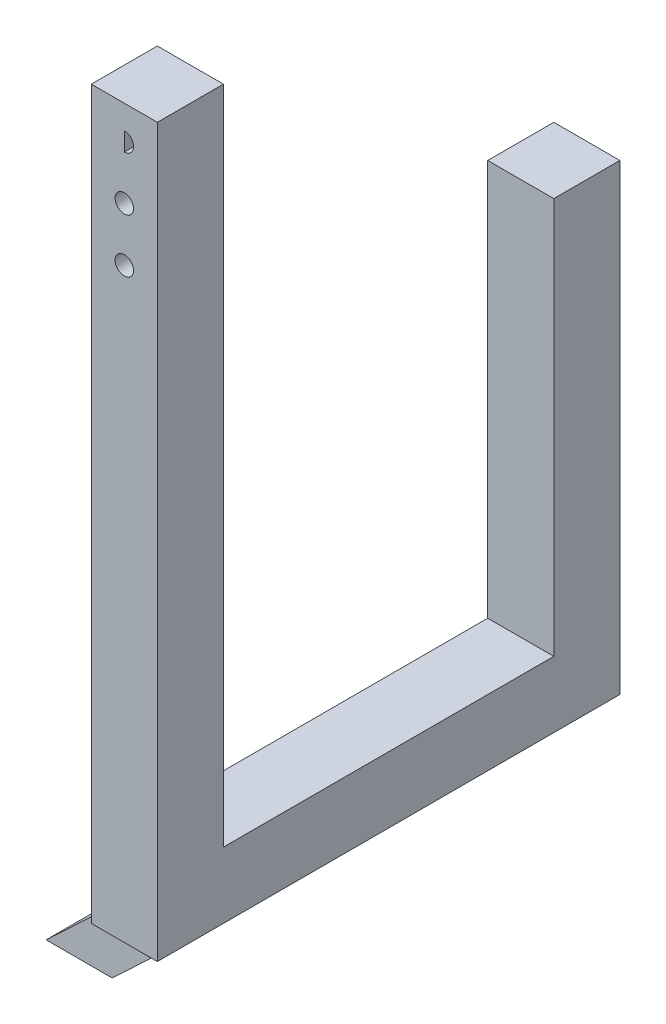
ISO-10303-21;
HEADER;
FILE_DESCRIPTION(('STEP AP214'),'2;1');
FILE_NAME('part.step','',(''),(''),'','','');
FILE_SCHEMA(('AUTOMOTIVE_DESIGN { 1 0 10303 214 1 1 1 1 }'));
ENDSEC;
DATA;
#1=APPLICATION_CONTEXT('core data for automotive mechanical design processes');
#2=APPLICATION_PROTOCOL_DEFINITION('international standard','automotive_design',2000,#1);
#3=PRODUCT_CONTEXT('',#1,'mechanical');
#4=PRODUCT('Part','Part','',(#3));
#5=PRODUCT_RELATED_PRODUCT_CATEGORY('part','',(#4));
#6=PRODUCT_DEFINITION_FORMATION('','',#4);
#7=PRODUCT_DEFINITION_CONTEXT('part definition',#1,'design');
#8=PRODUCT_DEFINITION('design','',#6,#7);
#9=PRODUCT_DEFINITION_SHAPE('','',#8);
#10=(LENGTH_UNIT() NAMED_UNIT(*) SI_UNIT(.MILLI.,.METRE.));
#11=(NAMED_UNIT(*) PLANE_ANGLE_UNIT() SI_UNIT($,.RADIAN.));
#12=(NAMED_UNIT(*) SI_UNIT($,.STERADIAN.) SOLID_ANGLE_UNIT());
#13=UNCERTAINTY_MEASURE_WITH_UNIT(LENGTH_MEASURE(1.E-05),#10,'distance_accuracy_value','');
#14=(GEOMETRIC_REPRESENTATION_CONTEXT(3) GLOBAL_UNCERTAINTY_ASSIGNED_CONTEXT((#13)) GLOBAL_UNIT_ASSIGNED_CONTEXT((#10,
#11,#12)) REPRESENTATION_CONTEXT('',''));
#15=CARTESIAN_POINT('',(0.,0.,0.));
#16=DIRECTION('',(0.,0.,1.));
#17=DIRECTION('',(1.,0.,0.));
#18=AXIS2_PLACEMENT_3D('',#15,#16,#17);
#19=CARTESIAN_POINT('',(0.,0.,12.7));
#20=DIRECTION('',(0.,1.,0.));
#21=DIRECTION('',(0.,0.,1.));
#22=AXIS2_PLACEMENT_3D('',#19,#20,#21);
#23=PLANE('',#22);
#24=DIRECTION('',(1.,0.,0.));
#25=VECTOR('',#24,1.);
#26=CARTESIAN_POINT('',(0.,0.,-63.5));
#27=LINE('',#26,#25);
#28=CARTESIAN_POINT('',(0.,0.,-63.5));
#29=VERTEX_POINT('',#28);
#30=CARTESIAN_POINT('',(12.7,0.,-63.5));
#31=VERTEX_POINT('',#30);
#32=EDGE_CURVE('E403',#29,#31,#27,.T.);
#33=ORIENTED_EDGE('',*,*,#32,.T.);
#34=DIRECTION('',(0.,0.,-1.));
#35=VECTOR('',#34,1.);
#36=CARTESIAN_POINT('',(12.7,0.,12.7));
#37=LINE('',#36,#35);
#38=CARTESIAN_POINT('',(12.7,0.,-19.05));
#39=VERTEX_POINT('',#38);
#40=EDGE_CURVE('E187',#39,#31,#37,.T.);
#41=ORIENTED_EDGE('',*,*,#40,.F.);
#42=DIRECTION('',(-1.,0.,0.));
#43=VECTOR('',#42,1.);
#44=CARTESIAN_POINT('',(12.7,0.,-19.05));
#45=LINE('',#44,#43);
#46=CARTESIAN_POINT('',(0.,0.,-19.05));
#47=VERTEX_POINT('',#46);
#48=EDGE_CURVE('E360',#39,#47,#45,.T.);
#49=ORIENTED_EDGE('',*,*,#48,.T.);
#50=DIRECTION('',(0.,0.,-1.));
#51=VECTOR('',#50,1.);
#52=CARTESIAN_POINT('',(0.,0.,12.7));
#53=LINE('',#52,#51);
#54=EDGE_CURVE('E268',#47,#29,#53,.T.);
#55=ORIENTED_EDGE('',*,*,#54,.T.);
#56=EDGE_LOOP('',(#33,#41,#49,#55));
#57=FACE_BOUND('',#56,.T.);
#58=ADVANCED_FACE('F40',(#57),#23,.F.);
#59=DIRECTION('',(-1.,0.,0.));
#60=VECTOR('',#59,1.);
#61=CARTESIAN_POINT('',(12.7,0.,-6.35));
#62=LINE('',#61,#60);
#63=CARTESIAN_POINT('',(12.7,0.,-6.35));
#64=VERTEX_POINT('',#63);
#65=CARTESIAN_POINT('',(0.,0.,-6.35));
#66=VERTEX_POINT('',#65);
#67=EDGE_CURVE('E189',#64,#66,#62,.T.);
#68=ORIENTED_EDGE('',*,*,#67,.F.);
#69=CARTESIAN_POINT('',(12.7,0.,12.7));
#70=VERTEX_POINT('',#69);
#71=EDGE_CURVE('E269',#70,#64,#37,.T.);
#72=ORIENTED_EDGE('',*,*,#71,.F.);
#73=DIRECTION('',(1.,0.,0.));
#74=VECTOR('',#73,1.);
#75=CARTESIAN_POINT('',(0.,0.,12.7));
#76=LINE('',#75,#74);
#77=CARTESIAN_POINT('',(0.,0.,12.7));
#78=VERTEX_POINT('',#77);
#79=EDGE_CURVE('E244',#78,#70,#76,.T.);
#80=ORIENTED_EDGE('',*,*,#79,.F.);
#81=EDGE_CURVE('E264',#78,#66,#53,.T.);
#82=ORIENTED_EDGE('',*,*,#81,.T.);
#83=EDGE_LOOP('',(#68,#72,#80,#82));
#84=FACE_BOUND('',#83,.T.);
#85=ADVANCED_FACE('F338',(#84),#23,.F.);
#86=CARTESIAN_POINT('',(0.,139.7,12.7));
#87=DIRECTION('',(0.,1.,0.));
#88=DIRECTION('',(0.,0.,1.));
#89=AXIS2_PLACEMENT_3D('',#86,#87,#88);
#90=PLANE('',#89);
#91=DIRECTION('',(1.,0.,0.));
#92=VECTOR('',#91,1.);
#93=CARTESIAN_POINT('',(0.,139.7,0.));
#94=LINE('',#93,#92);
#95=CARTESIAN_POINT('',(0.,139.7,0.));
#96=VERTEX_POINT('',#95);
#97=CARTESIAN_POINT('',(12.7,139.7,0.));
#98=VERTEX_POINT('',#97);
#99=EDGE_CURVE('E232',#96,#98,#94,.T.);
#100=ORIENTED_EDGE('',*,*,#99,.F.);
#101=DIRECTION('',(0.,0.,-1.));
#102=VECTOR('',#101,1.);
#103=CARTESIAN_POINT('',(0.,139.7,12.7));
#104=LINE('',#103,#102);
#105=CARTESIAN_POINT('',(0.,139.7,12.7));
#106=VERTEX_POINT('',#105);
#107=EDGE_CURVE('E260',#106,#96,#104,.T.);
#108=ORIENTED_EDGE('',*,*,#107,.F.);
#109=DIRECTION('',(1.,0.,0.));
#110=VECTOR('',#109,1.);
#111=CARTESIAN_POINT('',(0.,139.7,12.7));
#112=LINE('',#111,#110);
#113=CARTESIAN_POINT('',(12.7,139.7,12.7));
#114=VERTEX_POINT('',#113);
#115=EDGE_CURVE('E236',#106,#114,#112,.T.);
#116=ORIENTED_EDGE('',*,*,#115,.T.);
#117=DIRECTION('',(0.,0.,-1.));
#118=VECTOR('',#117,1.);
#119=CARTESIAN_POINT('',(12.7,139.7,12.7));
#120=LINE('',#119,#118);
#121=EDGE_CURVE('E251',#114,#98,#120,.T.);
#122=ORIENTED_EDGE('',*,*,#121,.T.);
#123=EDGE_LOOP('',(#100,#108,#116,#122));
#124=FACE_BOUND('',#123,.T.);
#125=ADVANCED_FACE('F42',(#124),#90,.T.);
#126=CARTESIAN_POINT('',(0.,0.,12.7));
#127=DIRECTION('',(-1.,0.,0.));
#128=DIRECTION('',(0.,0.,1.));
#129=AXIS2_PLACEMENT_3D('',#126,#127,#128);
#130=PLANE('',#129);
#131=DIRECTION('',(0.,1.,0.));
#132=VECTOR('',#131,1.);
#133=CARTESIAN_POINT('',(0.,0.,0.));
#134=LINE('',#133,#132);
#135=CARTESIAN_POINT('',(0.,12.7,0.));
#136=VERTEX_POINT('',#135);
#137=EDGE_CURVE('E241',#136,#96,#134,.T.);
#138=ORIENTED_EDGE('',*,*,#137,.F.);
#139=DIRECTION('',(0.,0.,-1.));
#140=VECTOR('',#139,1.);
#141=CARTESIAN_POINT('',(0.,12.7,0.));
#142=LINE('',#141,#140);
#143=CARTESIAN_POINT('',(0.,12.7,-63.5));
#144=VERTEX_POINT('',#143);
#145=EDGE_CURVE('E218',#136,#144,#142,.T.);
#146=ORIENTED_EDGE('',*,*,#145,.T.);
#147=DIRECTION('',(0.,1.,0.));
#148=VECTOR('',#147,1.);
#149=CARTESIAN_POINT('',(0.,0.,-63.5));
#150=LINE('',#149,#148);
#151=CARTESIAN_POINT('',(0.,88.9,-63.5));
#152=VERTEX_POINT('',#151);
#153=EDGE_CURVE('E206',#144,#152,#150,.T.);
#154=ORIENTED_EDGE('',*,*,#153,.T.);
#155=DIRECTION('',(0.,0.,-1.));
#156=VECTOR('',#155,1.);
#157=CARTESIAN_POINT('',(0.,88.9,-63.5));
#158=LINE('',#157,#156);
#159=CARTESIAN_POINT('',(0.,88.9,-76.2));
#160=VERTEX_POINT('',#159);
#161=EDGE_CURVE('E209',#152,#160,#158,.T.);
#162=ORIENTED_EDGE('',*,*,#161,.T.);
#163=DIRECTION('',(0.,-1.,0.));
#164=VECTOR('',#163,1.);
#165=CARTESIAN_POINT('',(0.,0.,-76.2));
#166=LINE('',#165,#164);
#167=CARTESIAN_POINT('',(0.,0.,-76.2));
#168=VERTEX_POINT('',#167);
#169=EDGE_CURVE('E213',#160,#168,#166,.T.);
#170=ORIENTED_EDGE('',*,*,#169,.T.);
#171=DIRECTION('',(0.,0.,1.));
#172=VECTOR('',#171,1.);
#173=CARTESIAN_POINT('',(0.,0.,-76.2));
#174=LINE('',#173,#172);
#175=EDGE_CURVE('E391',#168,#29,#174,.T.);
#176=ORIENTED_EDGE('',*,*,#175,.T.);
#177=ORIENTED_EDGE('',*,*,#54,.F.);
#178=DIRECTION('',(0.,0.,1.));
#179=VECTOR('',#178,1.);
#180=CARTESIAN_POINT('',(0.,0.,-19.05));
#181=LINE('',#180,#179);
#182=EDGE_CURVE('E368',#47,#66,#181,.T.);
#183=ORIENTED_EDGE('',*,*,#182,.T.);
#184=ORIENTED_EDGE('',*,*,#81,.F.);
#185=DIRECTION('',(0.,1.,0.));
#186=VECTOR('',#185,1.);
#187=CARTESIAN_POINT('',(0.,0.,12.7));
#188=LINE('',#187,#186);
#189=EDGE_CURVE('E247',#78,#106,#188,.T.);
#190=ORIENTED_EDGE('',*,*,#189,.T.);
#191=ORIENTED_EDGE('',*,*,#107,.T.);
#192=EDGE_LOOP('',(#138,#146,#154,#162,#170,#176,#177,#183,#184,#190,#191));
#193=FACE_BOUND('',#192,.T.);
#194=ADVANCED_FACE('F320',(#193),#130,.T.);
#195=CARTESIAN_POINT('',(12.7,0.,12.7));
#196=DIRECTION('',(-1.,0.,0.));
#197=DIRECTION('',(0.,0.,1.));
#198=AXIS2_PLACEMENT_3D('',#195,#196,#197);
#199=PLANE('',#198);
#200=ORIENTED_EDGE('',*,*,#71,.T.);
#201=DIRECTION('',(0.,0.,1.));
#202=VECTOR('',#201,1.);
#203=CARTESIAN_POINT('',(12.7,0.,-19.05));
#204=LINE('',#203,#202);
#205=EDGE_CURVE('E308',#39,#64,#204,.T.);
#206=ORIENTED_EDGE('',*,*,#205,.F.);
#207=ORIENTED_EDGE('',*,*,#40,.T.);
#208=DIRECTION('',(0.,0.,1.));
#209=VECTOR('',#208,1.);
#210=CARTESIAN_POINT('',(12.7,0.,-76.2));
#211=LINE('',#210,#209);
#212=CARTESIAN_POINT('',(12.7,0.,-76.2));
#213=VERTEX_POINT('',#212);
#214=EDGE_CURVE('E166',#213,#31,#211,.T.);
#215=ORIENTED_EDGE('',*,*,#214,.F.);
#216=DIRECTION('',(0.,-1.,0.));
#217=VECTOR('',#216,1.);
#218=CARTESIAN_POINT('',(12.7,0.,-76.2));
#219=LINE('',#218,#217);
#220=CARTESIAN_POINT('',(12.7,88.9,-76.2));
#221=VERTEX_POINT('',#220);
#222=EDGE_CURVE('E183',#221,#213,#219,.T.);
#223=ORIENTED_EDGE('',*,*,#222,.F.);
#224=DIRECTION('',(0.,0.,-1.));
#225=VECTOR('',#224,1.);
#226=CARTESIAN_POINT('',(12.7,88.9,-63.5));
#227=LINE('',#226,#225);
#228=CARTESIAN_POINT('',(12.7,88.9,-63.5));
#229=VERTEX_POINT('',#228);
#230=EDGE_CURVE('E196',#229,#221,#227,.T.);
#231=ORIENTED_EDGE('',*,*,#230,.F.);
#232=DIRECTION('',(0.,1.,0.));
#233=VECTOR('',#232,1.);
#234=CARTESIAN_POINT('',(12.7,0.,-63.5));
#235=LINE('',#234,#233);
#236=CARTESIAN_POINT('',(12.7,12.7,-63.5));
#237=VERTEX_POINT('',#236);
#238=EDGE_CURVE('E202',#237,#229,#235,.T.);
#239=ORIENTED_EDGE('',*,*,#238,.F.);
#240=DIRECTION('',(0.,0.,-1.));
#241=VECTOR('',#240,1.);
#242=CARTESIAN_POINT('',(12.7,12.7,0.));
#243=LINE('',#242,#241);
#244=CARTESIAN_POINT('',(12.7,12.7,0.));
#245=VERTEX_POINT('',#244);
#246=EDGE_CURVE('E220',#245,#237,#243,.T.);
#247=ORIENTED_EDGE('',*,*,#246,.F.);
#248=DIRECTION('',(0.,1.,0.));
#249=VECTOR('',#248,1.);
#250=CARTESIAN_POINT('',(12.7,0.,0.));
#251=LINE('',#250,#249);
#252=EDGE_CURVE('E255',#245,#98,#251,.T.);
#253=ORIENTED_EDGE('',*,*,#252,.T.);
#254=ORIENTED_EDGE('',*,*,#121,.F.);
#255=DIRECTION('',(0.,1.,0.));
#256=VECTOR('',#255,1.);
#257=CARTESIAN_POINT('',(12.7,0.,12.7));
#258=LINE('',#257,#256);
#259=EDGE_CURVE('E240',#70,#114,#258,.T.);
#260=ORIENTED_EDGE('',*,*,#259,.F.);
#261=EDGE_LOOP('',(#200,#206,#207,#215,#223,#231,#239,#247,#253,#254,#260));
#262=FACE_BOUND('',#261,.T.);
#263=ADVANCED_FACE('F181',(#262),#199,.F.);
#264=CARTESIAN_POINT('',(0.,0.,12.7));
#265=DIRECTION('',(0.,0.,1.));
#266=DIRECTION('',(1.,0.,0.));
#267=AXIS2_PLACEMENT_3D('',#264,#265,#266);
#268=PLANE('',#267);
#269=CARTESIAN_POINT('',(6.35,112.7125,12.7));
#270=DIRECTION('',(0.,0.,1.));
#271=DIRECTION('',(1.,0.,0.));
#272=AXIS2_PLACEMENT_3D('',#269,#270,#271);
#273=CIRCLE('',#272,1.778);
#274=CARTESIAN_POINT('',(8.128,112.7125,12.7));
#275=VERTEX_POINT('',#274);
#276=EDGE_CURVE('E279',#275,#275,#273,.T.);
#277=ORIENTED_EDGE('',*,*,#276,.F.);
#278=EDGE_LOOP('',(#277));
#279=FACE_BOUND('',#278,.T.);
#280=DIRECTION('',(0.,-1.,0.));
#281=VECTOR('',#280,1.);
#282=CARTESIAN_POINT('',(6.35000000000002,0.,12.7));
#283=LINE('',#282,#281);
#284=CARTESIAN_POINT('',(6.35,135.128,12.7));
#285=VERTEX_POINT('',#284);
#286=CARTESIAN_POINT('',(6.35,131.572,12.7));
#287=VERTEX_POINT('',#286);
#288=EDGE_CURVE('E65',#285,#287,#283,.T.);
#289=ORIENTED_EDGE('',*,*,#288,.F.);
#290=CARTESIAN_POINT('',(6.35,133.35,12.7));
#291=DIRECTION('',(0.,0.,1.));
#292=DIRECTION('',(1.,0.,0.));
#293=AXIS2_PLACEMENT_3D('',#290,#291,#292);
#294=CIRCLE('',#293,1.778);
#295=EDGE_CURVE('E294',#287,#285,#294,.T.);
#296=ORIENTED_EDGE('',*,*,#295,.F.);
#297=EDGE_LOOP('',(#289,#296));
#298=FACE_BOUND('',#297,.T.);
#299=CARTESIAN_POINT('',(6.35,123.03125,12.7));
#300=DIRECTION('',(0.,0.,1.));
#301=DIRECTION('',(1.,0.,0.));
#302=AXIS2_PLACEMENT_3D('',#299,#300,#301);
#303=CIRCLE('',#302,1.778);
#304=CARTESIAN_POINT('',(8.128,123.03125,12.7));
#305=VERTEX_POINT('',#304);
#306=EDGE_CURVE('E299',#305,#305,#303,.T.);
#307=ORIENTED_EDGE('',*,*,#306,.F.);
#308=EDGE_LOOP('',(#307));
#309=FACE_BOUND('',#308,.T.);
#310=ORIENTED_EDGE('',*,*,#115,.F.);
#311=ORIENTED_EDGE('',*,*,#189,.F.);
#312=ORIENTED_EDGE('',*,*,#79,.T.);
#313=ORIENTED_EDGE('',*,*,#259,.T.);
#314=EDGE_LOOP('',(#310,#311,#312,#313));
#315=FACE_BOUND('',#314,.T.);
#316=ADVANCED_FACE('F333',(#279,#298,#309,#315),#268,.T.);
#317=CARTESIAN_POINT('',(0.,0.,0.));
#318=DIRECTION('',(0.,0.,1.));
#319=DIRECTION('',(1.,0.,0.));
#320=AXIS2_PLACEMENT_3D('',#317,#318,#319);
#321=PLANE('',#320);
#322=CARTESIAN_POINT('',(6.35,112.7125,0.));
#323=DIRECTION('',(0.,0.,1.));
#324=DIRECTION('',(1.,0.,0.));
#325=AXIS2_PLACEMENT_3D('',#322,#323,#324);
#326=CIRCLE('',#325,1.778);
#327=CARTESIAN_POINT('',(8.128,112.7125,0.));
#328=VERTEX_POINT('',#327);
#329=EDGE_CURVE('E44',#328,#328,#326,.T.);
#330=ORIENTED_EDGE('',*,*,#329,.T.);
#331=EDGE_LOOP('',(#330));
#332=FACE_BOUND('',#331,.T.);
#333=CARTESIAN_POINT('',(6.35,133.35,0.));
#334=DIRECTION('',(0.,0.,1.));
#335=DIRECTION('',(1.,0.,0.));
#336=AXIS2_PLACEMENT_3D('',#333,#334,#335);
#337=CIRCLE('',#336,1.778);
#338=CARTESIAN_POINT('',(6.35,131.572,0.));
#339=VERTEX_POINT('',#338);
#340=CARTESIAN_POINT('',(6.35,135.128,0.));
#341=VERTEX_POINT('',#340);
#342=EDGE_CURVE('E50',#339,#341,#337,.T.);
#343=ORIENTED_EDGE('',*,*,#342,.T.);
#344=DIRECTION('',(0.,-1.,0.));
#345=VECTOR('',#344,1.);
#346=CARTESIAN_POINT('',(6.35000000000002,0.,0.));
#347=LINE('',#346,#345);
#348=EDGE_CURVE('E12',#341,#339,#347,.T.);
#349=ORIENTED_EDGE('',*,*,#348,.T.);
#350=EDGE_LOOP('',(#343,#349));
#351=FACE_BOUND('',#350,.T.);
#352=CARTESIAN_POINT('',(6.35,123.03125,0.));
#353=DIRECTION('',(0.,0.,1.));
#354=DIRECTION('',(1.,0.,0.));
#355=AXIS2_PLACEMENT_3D('',#352,#353,#354);
#356=CIRCLE('',#355,1.778);
#357=CARTESIAN_POINT('',(8.128,123.03125,0.));
#358=VERTEX_POINT('',#357);
#359=EDGE_CURVE('E275',#358,#358,#356,.T.);
#360=ORIENTED_EDGE('',*,*,#359,.T.);
#361=EDGE_LOOP('',(#360));
#362=FACE_BOUND('',#361,.T.);
#363=ORIENTED_EDGE('',*,*,#252,.F.);
#364=DIRECTION('',(-1.,0.,0.));
#365=VECTOR('',#364,1.);
#366=CARTESIAN_POINT('',(12.7,12.7,0.));
#367=LINE('',#366,#365);
#368=EDGE_CURVE('E228',#245,#136,#367,.T.);
#369=ORIENTED_EDGE('',*,*,#368,.T.);
#370=ORIENTED_EDGE('',*,*,#137,.T.);
#371=ORIENTED_EDGE('',*,*,#99,.T.);
#372=EDGE_LOOP('',(#363,#369,#370,#371));
#373=FACE_BOUND('',#372,.T.);
#374=ADVANCED_FACE('F283',(#332,#351,#362,#373),#321,.F.);
#375=CARTESIAN_POINT('',(12.7,12.7,0.));
#376=DIRECTION('',(0.,1.,0.));
#377=DIRECTION('',(0.,0.,1.));
#378=AXIS2_PLACEMENT_3D('',#375,#376,#377);
#379=PLANE('',#378);
#380=ORIENTED_EDGE('',*,*,#145,.F.);
#381=ORIENTED_EDGE('',*,*,#368,.F.);
#382=ORIENTED_EDGE('',*,*,#246,.T.);
#383=DIRECTION('',(-1.,0.,0.));
#384=VECTOR('',#383,1.);
#385=CARTESIAN_POINT('',(12.7,12.7,-63.5));
#386=LINE('',#385,#384);
#387=EDGE_CURVE('E224',#237,#144,#386,.T.);
#388=ORIENTED_EDGE('',*,*,#387,.T.);
#389=EDGE_LOOP('',(#380,#381,#382,#388));
#390=FACE_BOUND('',#389,.T.);
#391=ADVANCED_FACE('F323',(#390),#379,.T.);
#392=CARTESIAN_POINT('',(12.7,0.,-63.5));
#393=DIRECTION('',(0.,0.,1.));
#394=DIRECTION('',(1.,0.,0.));
#395=AXIS2_PLACEMENT_3D('',#392,#393,#394);
#396=PLANE('',#395);
#397=ORIENTED_EDGE('',*,*,#387,.F.);
#398=ORIENTED_EDGE('',*,*,#238,.T.);
#399=DIRECTION('',(-1.,0.,0.));
#400=VECTOR('',#399,1.);
#401=CARTESIAN_POINT('',(12.7,88.9,-63.5));
#402=LINE('',#401,#400);
#403=EDGE_CURVE('E195',#229,#152,#402,.T.);
#404=ORIENTED_EDGE('',*,*,#403,.T.);
#405=ORIENTED_EDGE('',*,*,#153,.F.);
#406=EDGE_LOOP('',(#397,#398,#404,#405));
#407=FACE_BOUND('',#406,.T.);
#408=ADVANCED_FACE('F313',(#407),#396,.T.);
#409=CARTESIAN_POINT('',(12.7,0.,-76.2));
#410=DIRECTION('',(0.,0.,-1.));
#411=DIRECTION('',(-1.,0.,0.));
#412=AXIS2_PLACEMENT_3D('',#409,#410,#411);
#413=PLANE('',#412);
#414=ORIENTED_EDGE('',*,*,#169,.F.);
#415=DIRECTION('',(-1.,0.,0.));
#416=VECTOR('',#415,1.);
#417=CARTESIAN_POINT('',(12.7,88.9,-76.2));
#418=LINE('',#417,#416);
#419=EDGE_CURVE('E193',#221,#160,#418,.T.);
#420=ORIENTED_EDGE('',*,*,#419,.F.);
#421=ORIENTED_EDGE('',*,*,#222,.T.);
#422=DIRECTION('',(-0.727812180980491,-0.685776515503717,0.));
#423=VECTOR('',#422,1.);
#424=CARTESIAN_POINT('',(12.7,0.,-76.2));
#425=LINE('',#424,#423);
#426=CARTESIAN_POINT('',(-15.0296440953567,-26.1280852406916,-76.2));
#427=VERTEX_POINT('',#426);
#428=EDGE_CURVE('E163',#213,#427,#425,.T.);
#429=ORIENTED_EDGE('',*,*,#428,.T.);
#430=DIRECTION('',(-1.,0.,0.));
#431=VECTOR('',#430,1.);
#432=CARTESIAN_POINT('',(-15.0296440953567,-26.1280852406916,-76.2));
#433=LINE('',#432,#431);
#434=CARTESIAN_POINT('',(-27.7296440953567,-26.1280852406916,-76.2));
#435=VERTEX_POINT('',#434);
#436=EDGE_CURVE('E174',#427,#435,#433,.T.);
#437=ORIENTED_EDGE('',*,*,#436,.T.);
#438=DIRECTION('',(0.727812180980491,0.685776515503717,0.));
#439=VECTOR('',#438,1.);
#440=CARTESIAN_POINT('',(-27.7296440953567,-26.1280852406916,-76.2));
#441=LINE('',#440,#439);
#442=EDGE_CURVE('E394',#435,#168,#441,.T.);
#443=ORIENTED_EDGE('',*,*,#442,.T.);
#444=EDGE_LOOP('',(#414,#420,#421,#429,#437,#443));
#445=FACE_BOUND('',#444,.T.);
#446=ADVANCED_FACE('F192',(#445),#413,.T.);
#447=CARTESIAN_POINT('',(12.7,88.9,-63.5));
#448=DIRECTION('',(0.,1.,0.));
#449=DIRECTION('',(0.,0.,1.));
#450=AXIS2_PLACEMENT_3D('',#447,#448,#449);
#451=PLANE('',#450);
#452=ORIENTED_EDGE('',*,*,#161,.F.);
#453=ORIENTED_EDGE('',*,*,#403,.F.);
#454=ORIENTED_EDGE('',*,*,#230,.T.);
#455=ORIENTED_EDGE('',*,*,#419,.T.);
#456=EDGE_LOOP('',(#452,#453,#454,#455));
#457=FACE_BOUND('',#456,.T.);
#458=ADVANCED_FACE('F317',(#457),#451,.T.);
#459=CARTESIAN_POINT('',(6.35,123.03125,-76.2));
#460=DIRECTION('',(0.,0.,1.));
#461=DIRECTION('',(1.,0.,0.));
#462=AXIS2_PLACEMENT_3D('',#459,#460,#461);
#463=CYLINDRICAL_SURFACE('',#462,1.778);
#464=ORIENTED_EDGE('',*,*,#306,.T.);
#465=EDGE_LOOP('',(#464));
#466=FACE_BOUND('',#465,.T.);
#467=ORIENTED_EDGE('',*,*,#359,.F.);
#468=EDGE_LOOP('',(#467));
#469=FACE_BOUND('',#468,.T.);
#470=ADVANCED_FACE('F575',(#466,#469),#463,.F.);
#471=CARTESIAN_POINT('',(6.35000000000002,0.,-76.2));
#472=DIRECTION('',(-1.,0.,0.));
#473=DIRECTION('',(0.,-1.,0.));
#474=AXIS2_PLACEMENT_3D('',#471,#472,#473);
#475=PLANE('',#474);
#476=DIRECTION('',(0.,0.,1.));
#477=VECTOR('',#476,1.);
#478=CARTESIAN_POINT('',(6.35,135.128,-76.2));
#479=LINE('',#478,#477);
#480=EDGE_CURVE('E291',#341,#285,#479,.T.);
#481=ORIENTED_EDGE('',*,*,#480,.T.);
#482=ORIENTED_EDGE('',*,*,#288,.T.);
#483=DIRECTION('',(0.,0.,1.));
#484=VECTOR('',#483,1.);
#485=CARTESIAN_POINT('',(6.35,131.572,-76.2));
#486=LINE('',#485,#484);
#487=EDGE_CURVE('E289',#339,#287,#486,.T.);
#488=ORIENTED_EDGE('',*,*,#487,.F.);
#489=ORIENTED_EDGE('',*,*,#348,.F.);
#490=EDGE_LOOP('',(#481,#482,#488,#489));
#491=FACE_BOUND('',#490,.T.);
#492=ADVANCED_FACE('F292',(#491),#475,.F.);
#493=CARTESIAN_POINT('',(6.35,133.35,-76.2));
#494=DIRECTION('',(0.,0.,1.));
#495=DIRECTION('',(1.,0.,0.));
#496=AXIS2_PLACEMENT_3D('',#493,#494,#495);
#497=CYLINDRICAL_SURFACE('',#496,1.778);
#498=ORIENTED_EDGE('',*,*,#487,.T.);
#499=ORIENTED_EDGE('',*,*,#295,.T.);
#500=ORIENTED_EDGE('',*,*,#480,.F.);
#501=ORIENTED_EDGE('',*,*,#342,.F.);
#502=EDGE_LOOP('',(#498,#499,#500,#501));
#503=FACE_BOUND('',#502,.T.);
#504=ADVANCED_FACE('F287',(#503),#497,.F.);
#505=CARTESIAN_POINT('',(6.35,112.7125,-76.2));
#506=DIRECTION('',(0.,0.,1.));
#507=DIRECTION('',(1.,0.,0.));
#508=AXIS2_PLACEMENT_3D('',#505,#506,#507);
#509=CYLINDRICAL_SURFACE('',#508,1.778);
#510=ORIENTED_EDGE('',*,*,#276,.T.);
#511=EDGE_LOOP('',(#510));
#512=FACE_BOUND('',#511,.T.);
#513=ORIENTED_EDGE('',*,*,#329,.F.);
#514=EDGE_LOOP('',(#513));
#515=FACE_BOUND('',#514,.T.);
#516=ADVANCED_FACE('F438',(#512,#515),#509,.F.);
#517=CARTESIAN_POINT('',(-15.0296440953567,-26.1280852406916,-19.05));
#518=DIRECTION('',(0.685776515503717,-0.727812180980491,0.));
#519=DIRECTION('',(0.727812180980491,0.685776515503718,0.));
#520=AXIS2_PLACEMENT_3D('',#517,#518,#519);
#521=PLANE('',#520);
#522=DIRECTION('',(0.727812180980491,0.685776515503717,0.));
#523=VECTOR('',#522,1.);
#524=CARTESIAN_POINT('',(-15.0296440953567,-26.1280852406916,-6.35));
#525=LINE('',#524,#523);
#526=CARTESIAN_POINT('',(-15.0296440953567,-26.1280852406916,-6.35));
#527=VERTEX_POINT('',#526);
#528=EDGE_CURVE('E357',#527,#64,#525,.T.);
#529=ORIENTED_EDGE('',*,*,#528,.F.);
#530=DIRECTION('',(0.,0.,1.));
#531=VECTOR('',#530,1.);
#532=CARTESIAN_POINT('',(-15.0296440953567,-26.1280852406916,-19.05));
#533=LINE('',#532,#531);
#534=CARTESIAN_POINT('',(-15.0296440953567,-26.1280852406916,-19.05));
#535=VERTEX_POINT('',#534);
#536=EDGE_CURVE('E363',#535,#527,#533,.T.);
#537=ORIENTED_EDGE('',*,*,#536,.F.);
#538=DIRECTION('',(0.727812180980491,0.685776515503717,0.));
#539=VECTOR('',#538,1.);
#540=CARTESIAN_POINT('',(-15.0296440953567,-26.1280852406916,-19.05));
#541=LINE('',#540,#539);
#542=EDGE_CURVE('E351',#535,#39,#541,.T.);
#543=ORIENTED_EDGE('',*,*,#542,.T.);
#544=ORIENTED_EDGE('',*,*,#205,.T.);
#545=EDGE_LOOP('',(#529,#537,#543,#544));
#546=FACE_BOUND('',#545,.T.);
#547=ADVANCED_FACE('F429',(#546),#521,.T.);
#548=CARTESIAN_POINT('',(-27.7296440953567,-26.1280852406916,-19.05));
#549=DIRECTION('',(0.,-1.,0.));
#550=DIRECTION('',(0.,0.,-1.));
#551=AXIS2_PLACEMENT_3D('',#548,#549,#550);
#552=PLANE('',#551);
#553=DIRECTION('',(1.,0.,0.));
#554=VECTOR('',#553,1.);
#555=CARTESIAN_POINT('',(-27.7296440953567,-26.1280852406916,-6.35));
#556=LINE('',#555,#554);
#557=CARTESIAN_POINT('',(-27.7296440953567,-26.1280852406916,-6.35));
#558=VERTEX_POINT('',#557);
#559=EDGE_CURVE('E348',#558,#527,#556,.T.);
#560=ORIENTED_EDGE('',*,*,#559,.F.);
#561=DIRECTION('',(0.,0.,1.));
#562=VECTOR('',#561,1.);
#563=CARTESIAN_POINT('',(-27.7296440953567,-26.1280852406916,-19.05));
#564=LINE('',#563,#562);
#565=CARTESIAN_POINT('',(-27.7296440953567,-26.1280852406916,-19.05));
#566=VERTEX_POINT('',#565);
#567=EDGE_CURVE('E366',#566,#558,#564,.T.);
#568=ORIENTED_EDGE('',*,*,#567,.F.);
#569=DIRECTION('',(1.,0.,0.));
#570=VECTOR('',#569,1.);
#571=CARTESIAN_POINT('',(-27.7296440953567,-26.1280852406916,-19.05));
#572=LINE('',#571,#570);
#573=EDGE_CURVE('E373',#566,#535,#572,.T.);
#574=ORIENTED_EDGE('',*,*,#573,.T.);
#575=ORIENTED_EDGE('',*,*,#536,.T.);
#576=EDGE_LOOP('',(#560,#568,#574,#575));
#577=FACE_BOUND('',#576,.T.);
#578=ADVANCED_FACE('F430',(#577),#552,.T.);
#579=CARTESIAN_POINT('',(0.,0.,-19.05));
#580=DIRECTION('',(-0.685776515503717,0.727812180980491,0.));
#581=DIRECTION('',(-0.727812180980491,-0.685776515503718,0.));
#582=AXIS2_PLACEMENT_3D('',#579,#580,#581);
#583=PLANE('',#582);
#584=DIRECTION('',(-0.727812180980491,-0.685776515503717,0.));
#585=VECTOR('',#584,1.);
#586=CARTESIAN_POINT('',(0.,0.,-6.35));
#587=LINE('',#586,#585);
#588=EDGE_CURVE('E345',#66,#558,#587,.T.);
#589=ORIENTED_EDGE('',*,*,#588,.F.);
#590=ORIENTED_EDGE('',*,*,#182,.F.);
#591=DIRECTION('',(-0.727812180980491,-0.685776515503717,0.));
#592=VECTOR('',#591,1.);
#593=CARTESIAN_POINT('',(0.,0.,-19.05));
#594=LINE('',#593,#592);
#595=EDGE_CURVE('E57',#47,#566,#594,.T.);
#596=ORIENTED_EDGE('',*,*,#595,.T.);
#597=ORIENTED_EDGE('',*,*,#567,.T.);
#598=EDGE_LOOP('',(#589,#590,#596,#597));
#599=FACE_BOUND('',#598,.T.);
#600=ADVANCED_FACE('F425',(#599),#583,.T.);
#601=CARTESIAN_POINT('',(0.,0.,-19.05));
#602=DIRECTION('',(0.,0.,1.));
#603=DIRECTION('',(1.,0.,0.));
#604=AXIS2_PLACEMENT_3D('',#601,#602,#603);
#605=PLANE('',#604);
#606=ORIENTED_EDGE('',*,*,#48,.F.);
#607=ORIENTED_EDGE('',*,*,#542,.F.);
#608=ORIENTED_EDGE('',*,*,#573,.F.);
#609=ORIENTED_EDGE('',*,*,#595,.F.);
#610=EDGE_LOOP('',(#606,#607,#608,#609));
#611=FACE_BOUND('',#610,.T.);
#612=ADVANCED_FACE('F423',(#611),#605,.F.);
#613=CARTESIAN_POINT('',(0.,0.,-6.35));
#614=DIRECTION('',(0.,0.,1.));
#615=DIRECTION('',(1.,0.,0.));
#616=AXIS2_PLACEMENT_3D('',#613,#614,#615);
#617=PLANE('',#616);
#618=ORIENTED_EDGE('',*,*,#67,.T.);
#619=ORIENTED_EDGE('',*,*,#588,.T.);
#620=ORIENTED_EDGE('',*,*,#559,.T.);
#621=ORIENTED_EDGE('',*,*,#528,.T.);
#622=EDGE_LOOP('',(#618,#619,#620,#621));
#623=FACE_BOUND('',#622,.T.);
#624=ADVANCED_FACE('F427',(#623),#617,.T.);
#625=CARTESIAN_POINT('',(12.7,0.,-76.2));
#626=DIRECTION('',(-0.685776515503717,0.727812180980491,0.));
#627=DIRECTION('',(-0.727812180980491,-0.685776515503718,0.));
#628=AXIS2_PLACEMENT_3D('',#625,#626,#627);
#629=PLANE('',#628);
#630=DIRECTION('',(-0.727812180980491,-0.685776515503717,0.));
#631=VECTOR('',#630,1.);
#632=CARTESIAN_POINT('',(12.7,0.,-63.5));
#633=LINE('',#632,#631);
#634=CARTESIAN_POINT('',(-15.0296440953567,-26.1280852406916,-63.5));
#635=VERTEX_POINT('',#634);
#636=EDGE_CURVE('E400',#31,#635,#633,.T.);
#637=ORIENTED_EDGE('',*,*,#636,.T.);
#638=DIRECTION('',(0.,0.,1.));
#639=VECTOR('',#638,1.);
#640=CARTESIAN_POINT('',(-15.0296440953567,-26.1280852406916,-76.2));
#641=LINE('',#640,#639);
#642=EDGE_CURVE('E169',#427,#635,#641,.T.);
#643=ORIENTED_EDGE('',*,*,#642,.F.);
#644=ORIENTED_EDGE('',*,*,#428,.F.);
#645=ORIENTED_EDGE('',*,*,#214,.T.);
#646=EDGE_LOOP('',(#637,#643,#644,#645));
#647=FACE_BOUND('',#646,.T.);
#648=ADVANCED_FACE('F165',(#647),#629,.F.);
#649=CARTESIAN_POINT('',(-15.0296440953567,-26.1280852406916,-76.2));
#650=DIRECTION('',(0.,1.,0.));
#651=DIRECTION('',(0.,0.,1.));
#652=AXIS2_PLACEMENT_3D('',#649,#650,#651);
#653=PLANE('',#652);
#654=DIRECTION('',(-1.,0.,0.));
#655=VECTOR('',#654,1.);
#656=CARTESIAN_POINT('',(-15.0296440953567,-26.1280852406916,-63.5));
#657=LINE('',#656,#655);
#658=CARTESIAN_POINT('',(-27.7296440953567,-26.1280852406916,-63.5));
#659=VERTEX_POINT('',#658);
#660=EDGE_CURVE('E397',#635,#659,#657,.T.);
#661=ORIENTED_EDGE('',*,*,#660,.T.);
#662=DIRECTION('',(0.,0.,1.));
#663=VECTOR('',#662,1.);
#664=CARTESIAN_POINT('',(-27.7296440953567,-26.1280852406916,-76.2));
#665=LINE('',#664,#663);
#666=EDGE_CURVE('E387',#435,#659,#665,.T.);
#667=ORIENTED_EDGE('',*,*,#666,.F.);
#668=ORIENTED_EDGE('',*,*,#436,.F.);
#669=ORIENTED_EDGE('',*,*,#642,.T.);
#670=EDGE_LOOP('',(#661,#667,#668,#669));
#671=FACE_BOUND('',#670,.T.);
#672=ADVANCED_FACE('F413',(#671),#653,.F.);
#673=CARTESIAN_POINT('',(-27.7296440953567,-26.1280852406916,-76.2));
#674=DIRECTION('',(0.685776515503717,-0.727812180980491,0.));
#675=DIRECTION('',(0.727812180980491,0.685776515503718,0.));
#676=AXIS2_PLACEMENT_3D('',#673,#674,#675);
#677=PLANE('',#676);
#678=DIRECTION('',(0.727812180980491,0.685776515503717,0.));
#679=VECTOR('',#678,1.);
#680=CARTESIAN_POINT('',(-27.7296440953567,-26.1280852406916,-63.5));
#681=LINE('',#680,#679);
#682=EDGE_CURVE('E175',#659,#29,#681,.T.);
#683=ORIENTED_EDGE('',*,*,#682,.T.);
#684=ORIENTED_EDGE('',*,*,#175,.F.);
#685=ORIENTED_EDGE('',*,*,#442,.F.);
#686=ORIENTED_EDGE('',*,*,#666,.T.);
#687=EDGE_LOOP('',(#683,#684,#685,#686));
#688=FACE_BOUND('',#687,.T.);
#689=ADVANCED_FACE('F417',(#688),#677,.F.);
#690=CARTESIAN_POINT('',(0.,0.,-63.5));
#691=DIRECTION('',(0.,0.,-1.));
#692=DIRECTION('',(-1.,0.,0.));
#693=AXIS2_PLACEMENT_3D('',#690,#691,#692);
#694=PLANE('',#693);
#695=ORIENTED_EDGE('',*,*,#32,.F.);
#696=ORIENTED_EDGE('',*,*,#682,.F.);
#697=ORIENTED_EDGE('',*,*,#660,.F.);
#698=ORIENTED_EDGE('',*,*,#636,.F.);
#699=EDGE_LOOP('',(#695,#696,#697,#698));
#700=FACE_BOUND('',#699,.T.);
#701=ADVANCED_FACE('F556',(#700),#694,.F.);
#702=CLOSED_SHELL('',(#58,#85,#125,#194,#263,#316,#374,#391,#408,#446,#458,#470,#492,#504,#516,
#547,#578,#600,#612,#624,#648,#672,#689,#701));
#703=MANIFOLD_SOLID_BREP('B2',#702);
#704=ADVANCED_BREP_SHAPE_REPRESENTATION('',(#18,#703),#14);
#705=SHAPE_DEFINITION_REPRESENTATION(#9,#704);
ENDSEC;
END-ISO-10303-21;
